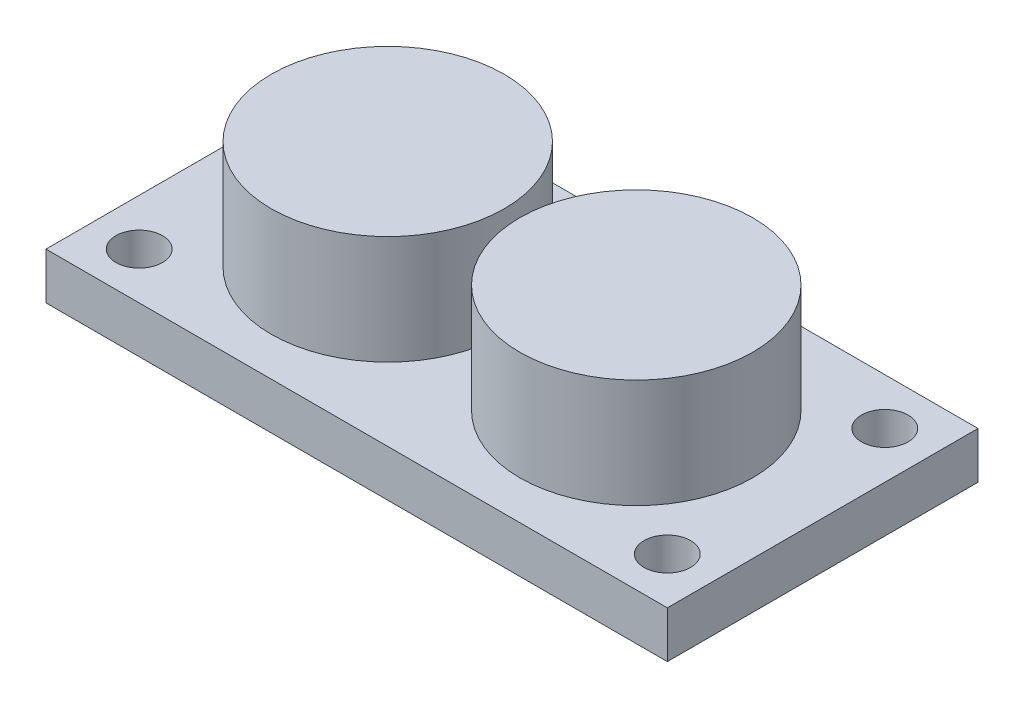
ISO-10303-21;
HEADER;
FILE_DESCRIPTION(('STEP AP214'),'2;1');
FILE_NAME('part.step','',(''),(''),'','','');
FILE_SCHEMA(('AUTOMOTIVE_DESIGN { 1 0 10303 214 1 1 1 1 }'));
ENDSEC;
DATA;
#1=APPLICATION_CONTEXT('core data for automotive mechanical design processes');
#2=APPLICATION_PROTOCOL_DEFINITION('international standard','automotive_design',2000,#1);
#3=PRODUCT_CONTEXT('',#1,'mechanical');
#4=PRODUCT('Part','Part','',(#3));
#5=PRODUCT_RELATED_PRODUCT_CATEGORY('part','',(#4));
#6=PRODUCT_DEFINITION_FORMATION('','',#4);
#7=PRODUCT_DEFINITION_CONTEXT('part definition',#1,'design');
#8=PRODUCT_DEFINITION('design','',#6,#7);
#9=PRODUCT_DEFINITION_SHAPE('','',#8);
#10=(LENGTH_UNIT() NAMED_UNIT(*) SI_UNIT(.MILLI.,.METRE.));
#11=(NAMED_UNIT(*) PLANE_ANGLE_UNIT() SI_UNIT($,.RADIAN.));
#12=(NAMED_UNIT(*) SI_UNIT($,.STERADIAN.) SOLID_ANGLE_UNIT());
#13=UNCERTAINTY_MEASURE_WITH_UNIT(LENGTH_MEASURE(1.E-05),#10,'distance_accuracy_value','');
#14=(GEOMETRIC_REPRESENTATION_CONTEXT(3) GLOBAL_UNCERTAINTY_ASSIGNED_CONTEXT((#13)) GLOBAL_UNIT_ASSIGNED_CONTEXT((#10,
#11,#12)) REPRESENTATION_CONTEXT('',''));
#15=CARTESIAN_POINT('',(0.,0.,0.));
#16=DIRECTION('',(0.,0.,1.));
#17=DIRECTION('',(1.,0.,0.));
#18=AXIS2_PLACEMENT_3D('',#15,#16,#17);
#19=CARTESIAN_POINT('',(0.,3.,0.));
#20=DIRECTION('',(0.,1.,0.));
#21=DIRECTION('',(0.,0.,1.));
#22=AXIS2_PLACEMENT_3D('',#19,#20,#21);
#23=PLANE('',#22);
#24=CARTESIAN_POINT('',(16.548532731377,3.,-5.84875846501129));
#25=DIRECTION('',(0.,1.,0.));
#26=DIRECTION('',(0.,0.,-1.));
#27=AXIS2_PLACEMENT_3D('',#24,#25,#26);
#28=CIRCLE('',#27,1.5);
#29=CARTESIAN_POINT('',(16.548532731377,3.,-7.34875846501129));
#30=VERTEX_POINT('',#29);
#31=EDGE_CURVE('E154',#30,#30,#28,.T.);
#32=ORIENTED_EDGE('',*,*,#31,.F.);
#33=EDGE_LOOP('',(#32));
#34=FACE_BOUND('',#33,.T.);
#35=CARTESIAN_POINT('',(-8.451467268623,3.,1.15124153498871));
#36=DIRECTION('',(0.,1.,0.));
#37=DIRECTION('',(0.,0.,1.));
#38=AXIS2_PLACEMENT_3D('',#35,#36,#37);
#39=CIRCLE('',#38,7.5);
#40=CARTESIAN_POINT('',(-8.451467268623,3.,8.65124153498871));
#41=VERTEX_POINT('',#40);
#42=EDGE_CURVE('E142',#41,#41,#39,.T.);
#43=ORIENTED_EDGE('',*,*,#42,.F.);
#44=EDGE_LOOP('',(#43));
#45=FACE_BOUND('',#44,.T.);
#46=CARTESIAN_POINT('',(-17.451467268623,3.,-5.84875846501129));
#47=DIRECTION('',(0.,1.,0.));
#48=DIRECTION('',(0.,0.,1.));
#49=AXIS2_PLACEMENT_3D('',#46,#47,#48);
#50=CIRCLE('',#49,1.5);
#51=CARTESIAN_POINT('',(-17.451467268623,3.,-4.34875846501129));
#52=VERTEX_POINT('',#51);
#53=EDGE_CURVE('E112',#52,#52,#50,.T.);
#54=ORIENTED_EDGE('',*,*,#53,.F.);
#55=EDGE_LOOP('',(#54));
#56=FACE_BOUND('',#55,.T.);
#57=DIRECTION('',(0.,0.,1.));
#58=VECTOR('',#57,1.);
#59=CARTESIAN_POINT('',(-20.451467268623,3.,-8.84875846501129));
#60=LINE('',#59,#58);
#61=CARTESIAN_POINT('',(-20.451467268623,3.,-8.84875846501129));
#62=VERTEX_POINT('',#61);
#63=CARTESIAN_POINT('',(-20.451467268623,3.,11.1512415349887));
#64=VERTEX_POINT('',#63);
#65=EDGE_CURVE('E92',#62,#64,#60,.T.);
#66=ORIENTED_EDGE('',*,*,#65,.T.);
#67=DIRECTION('',(1.,0.,0.));
#68=VECTOR('',#67,1.);
#69=CARTESIAN_POINT('',(-20.451467268623,3.,11.1512415349887));
#70=LINE('',#69,#68);
#71=CARTESIAN_POINT('',(19.548532731377,3.,11.1512415349887));
#72=VERTEX_POINT('',#71);
#73=EDGE_CURVE('E87',#64,#72,#70,.T.);
#74=ORIENTED_EDGE('',*,*,#73,.T.);
#75=DIRECTION('',(0.,0.,-1.));
#76=VECTOR('',#75,1.);
#77=CARTESIAN_POINT('',(19.548532731377,3.,-8.84875846501129));
#78=LINE('',#77,#76);
#79=CARTESIAN_POINT('',(19.548532731377,3.,-8.84875846501129));
#80=VERTEX_POINT('',#79);
#81=EDGE_CURVE('E90',#72,#80,#78,.T.);
#82=ORIENTED_EDGE('',*,*,#81,.T.);
#83=DIRECTION('',(-1.,0.,0.));
#84=VECTOR('',#83,1.);
#85=CARTESIAN_POINT('',(-20.451467268623,3.,-8.84875846501129));
#86=LINE('',#85,#84);
#87=EDGE_CURVE('E57',#80,#62,#86,.T.);
#88=ORIENTED_EDGE('',*,*,#87,.T.);
#89=EDGE_LOOP('',(#66,#74,#82,#88));
#90=FACE_BOUND('',#89,.T.);
#91=CARTESIAN_POINT('',(-17.451467268623,3.,8.15124153498871));
#92=DIRECTION('',(0.,1.,0.));
#93=DIRECTION('',(0.,0.,1.));
#94=AXIS2_PLACEMENT_3D('',#91,#92,#93);
#95=CIRCLE('',#94,1.5);
#96=CARTESIAN_POINT('',(-17.451467268623,3.,9.65124153498872));
#97=VERTEX_POINT('',#96);
#98=EDGE_CURVE('E134',#97,#97,#95,.T.);
#99=ORIENTED_EDGE('',*,*,#98,.F.);
#100=EDGE_LOOP('',(#99));
#101=FACE_BOUND('',#100,.T.);
#102=CARTESIAN_POINT('',(16.548532731377,3.,8.15124153498871));
#103=DIRECTION('',(0.,1.,0.));
#104=DIRECTION('',(0.,0.,-1.));
#105=AXIS2_PLACEMENT_3D('',#102,#103,#104);
#106=CIRCLE('',#105,1.5);
#107=CARTESIAN_POINT('',(16.548532731377,3.,6.65124153498871));
#108=VERTEX_POINT('',#107);
#109=EDGE_CURVE('E149',#108,#108,#106,.T.);
#110=ORIENTED_EDGE('',*,*,#109,.F.);
#111=EDGE_LOOP('',(#110));
#112=FACE_BOUND('',#111,.T.);
#113=CARTESIAN_POINT('',(7.54853273137699,3.,1.15124153498871));
#114=DIRECTION('',(0.,1.,0.));
#115=DIRECTION('',(0.,0.,-1.));
#116=AXIS2_PLACEMENT_3D('',#113,#114,#115);
#117=CIRCLE('',#116,7.5);
#118=CARTESIAN_POINT('',(7.54853273137699,3.,-6.34875846501129));
#119=VERTEX_POINT('',#118);
#120=EDGE_CURVE('E162',#119,#119,#117,.T.);
#121=ORIENTED_EDGE('',*,*,#120,.F.);
#122=EDGE_LOOP('',(#121));
#123=FACE_BOUND('',#122,.T.);
#124=ADVANCED_FACE('F39',(#34,#45,#56,#90,#101,#112,#123),#23,.T.);
#125=CARTESIAN_POINT('',(0.,0.,0.));
#126=DIRECTION('',(0.,1.,0.));
#127=DIRECTION('',(0.,0.,1.));
#128=AXIS2_PLACEMENT_3D('',#125,#126,#127);
#129=PLANE('',#128);
#130=DIRECTION('',(0.,0.,1.));
#131=VECTOR('',#130,1.);
#132=CARTESIAN_POINT('',(-20.451467268623,0.,-8.84875846501129));
#133=LINE('',#132,#131);
#134=CARTESIAN_POINT('',(-20.451467268623,0.,-8.84875846501129));
#135=VERTEX_POINT('',#134);
#136=CARTESIAN_POINT('',(-20.451467268623,0.,11.1512415349887));
#137=VERTEX_POINT('',#136);
#138=EDGE_CURVE('E108',#135,#137,#133,.T.);
#139=ORIENTED_EDGE('',*,*,#138,.F.);
#140=DIRECTION('',(-1.,0.,0.));
#141=VECTOR('',#140,1.);
#142=CARTESIAN_POINT('',(-20.451467268623,0.,-8.84875846501129));
#143=LINE('',#142,#141);
#144=CARTESIAN_POINT('',(19.548532731377,0.,-8.84875846501129));
#145=VERTEX_POINT('',#144);
#146=EDGE_CURVE('E80',#145,#135,#143,.T.);
#147=ORIENTED_EDGE('',*,*,#146,.F.);
#148=DIRECTION('',(0.,0.,-1.));
#149=VECTOR('',#148,1.);
#150=CARTESIAN_POINT('',(19.548532731377,0.,-8.84875846501129));
#151=LINE('',#150,#149);
#152=CARTESIAN_POINT('',(19.548532731377,0.,11.1512415349887));
#153=VERTEX_POINT('',#152);
#154=EDGE_CURVE('E74',#153,#145,#151,.T.);
#155=ORIENTED_EDGE('',*,*,#154,.F.);
#156=DIRECTION('',(1.,0.,0.));
#157=VECTOR('',#156,1.);
#158=CARTESIAN_POINT('',(-20.451467268623,0.,11.1512415349887));
#159=LINE('',#158,#157);
#160=EDGE_CURVE('E97',#137,#153,#159,.T.);
#161=ORIENTED_EDGE('',*,*,#160,.F.);
#162=EDGE_LOOP('',(#139,#147,#155,#161));
#163=FACE_BOUND('',#162,.T.);
#164=CARTESIAN_POINT('',(-17.451467268623,0.,-5.84875846501129));
#165=DIRECTION('',(0.,1.,0.));
#166=DIRECTION('',(0.,0.,1.));
#167=AXIS2_PLACEMENT_3D('',#164,#165,#166);
#168=CIRCLE('',#167,1.5);
#169=CARTESIAN_POINT('',(-17.451467268623,0.,-4.34875846501129));
#170=VERTEX_POINT('',#169);
#171=EDGE_CURVE('E130',#170,#170,#168,.T.);
#172=ORIENTED_EDGE('',*,*,#171,.T.);
#173=EDGE_LOOP('',(#172));
#174=FACE_BOUND('',#173,.T.);
#175=CARTESIAN_POINT('',(-17.451467268623,0.,8.15124153498871));
#176=DIRECTION('',(0.,1.,0.));
#177=DIRECTION('',(0.,0.,1.));
#178=AXIS2_PLACEMENT_3D('',#175,#176,#177);
#179=CIRCLE('',#178,1.5);
#180=CARTESIAN_POINT('',(-17.451467268623,0.,9.65124153498872));
#181=VERTEX_POINT('',#180);
#182=EDGE_CURVE('E138',#181,#181,#179,.T.);
#183=ORIENTED_EDGE('',*,*,#182,.T.);
#184=EDGE_LOOP('',(#183));
#185=FACE_BOUND('',#184,.T.);
#186=CARTESIAN_POINT('',(16.548532731377,0.,8.15124153498871));
#187=DIRECTION('',(0.,1.,0.));
#188=DIRECTION('',(0.,0.,-1.));
#189=AXIS2_PLACEMENT_3D('',#186,#187,#188);
#190=CIRCLE('',#189,1.5);
#191=CARTESIAN_POINT('',(16.548532731377,0.,6.65124153498871));
#192=VERTEX_POINT('',#191);
#193=EDGE_CURVE('E150',#192,#192,#190,.T.);
#194=ORIENTED_EDGE('',*,*,#193,.T.);
#195=EDGE_LOOP('',(#194));
#196=FACE_BOUND('',#195,.T.);
#197=CARTESIAN_POINT('',(16.548532731377,0.,-5.84875846501129));
#198=DIRECTION('',(0.,1.,0.));
#199=DIRECTION('',(0.,0.,-1.));
#200=AXIS2_PLACEMENT_3D('',#197,#198,#199);
#201=CIRCLE('',#200,1.5);
#202=CARTESIAN_POINT('',(16.548532731377,0.,-7.34875846501129));
#203=VERTEX_POINT('',#202);
#204=EDGE_CURVE('E158',#203,#203,#201,.T.);
#205=ORIENTED_EDGE('',*,*,#204,.T.);
#206=EDGE_LOOP('',(#205));
#207=FACE_BOUND('',#206,.T.);
#208=ADVANCED_FACE('F125',(#163,#174,#185,#196,#207),#129,.F.);
#209=CARTESIAN_POINT('',(-20.451467268623,3.,-8.84875846501129));
#210=DIRECTION('',(1.,0.,0.));
#211=DIRECTION('',(0.,0.,-1.));
#212=AXIS2_PLACEMENT_3D('',#209,#210,#211);
#213=PLANE('',#212);
#214=ORIENTED_EDGE('',*,*,#138,.T.);
#215=DIRECTION('',(0.,-1.,0.));
#216=VECTOR('',#215,1.);
#217=CARTESIAN_POINT('',(-20.451467268623,3.,11.1512415349887));
#218=LINE('',#217,#216);
#219=EDGE_CURVE('E11',#64,#137,#218,.T.);
#220=ORIENTED_EDGE('',*,*,#219,.F.);
#221=ORIENTED_EDGE('',*,*,#65,.F.);
#222=DIRECTION('',(0.,-1.,0.));
#223=VECTOR('',#222,1.);
#224=CARTESIAN_POINT('',(-20.451467268623,3.,-8.84875846501129));
#225=LINE('',#224,#223);
#226=EDGE_CURVE('E104',#62,#135,#225,.T.);
#227=ORIENTED_EDGE('',*,*,#226,.T.);
#228=EDGE_LOOP('',(#214,#220,#221,#227));
#229=FACE_BOUND('',#228,.T.);
#230=ADVANCED_FACE('F41',(#229),#213,.F.);
#231=CARTESIAN_POINT('',(-20.451467268623,3.,11.1512415349887));
#232=DIRECTION('',(0.,0.,-1.));
#233=DIRECTION('',(-1.,0.,0.));
#234=AXIS2_PLACEMENT_3D('',#231,#232,#233);
#235=PLANE('',#234);
#236=ORIENTED_EDGE('',*,*,#160,.T.);
#237=DIRECTION('',(0.,-1.,0.));
#238=VECTOR('',#237,1.);
#239=CARTESIAN_POINT('',(19.548532731377,3.,11.1512415349887));
#240=LINE('',#239,#238);
#241=EDGE_CURVE('E49',#72,#153,#240,.T.);
#242=ORIENTED_EDGE('',*,*,#241,.F.);
#243=ORIENTED_EDGE('',*,*,#73,.F.);
#244=ORIENTED_EDGE('',*,*,#219,.T.);
#245=EDGE_LOOP('',(#236,#242,#243,#244));
#246=FACE_BOUND('',#245,.T.);
#247=ADVANCED_FACE('F96',(#246),#235,.F.);
#248=CARTESIAN_POINT('',(19.548532731377,3.,-8.84875846501129));
#249=DIRECTION('',(-1.,0.,0.));
#250=DIRECTION('',(0.,0.,1.));
#251=AXIS2_PLACEMENT_3D('',#248,#249,#250);
#252=PLANE('',#251);
#253=ORIENTED_EDGE('',*,*,#154,.T.);
#254=DIRECTION('',(0.,-1.,0.));
#255=VECTOR('',#254,1.);
#256=CARTESIAN_POINT('',(19.548532731377,3.,-8.84875846501129));
#257=LINE('',#256,#255);
#258=EDGE_CURVE('E99',#80,#145,#257,.T.);
#259=ORIENTED_EDGE('',*,*,#258,.F.);
#260=ORIENTED_EDGE('',*,*,#81,.F.);
#261=ORIENTED_EDGE('',*,*,#241,.T.);
#262=EDGE_LOOP('',(#253,#259,#260,#261));
#263=FACE_BOUND('',#262,.T.);
#264=ADVANCED_FACE('F100',(#263),#252,.F.);
#265=CARTESIAN_POINT('',(-20.451467268623,3.,-8.84875846501129));
#266=DIRECTION('',(0.,0.,1.));
#267=DIRECTION('',(1.,0.,0.));
#268=AXIS2_PLACEMENT_3D('',#265,#266,#267);
#269=PLANE('',#268);
#270=ORIENTED_EDGE('',*,*,#146,.T.);
#271=ORIENTED_EDGE('',*,*,#226,.F.);
#272=ORIENTED_EDGE('',*,*,#87,.F.);
#273=ORIENTED_EDGE('',*,*,#258,.T.);
#274=EDGE_LOOP('',(#270,#271,#272,#273));
#275=FACE_BOUND('',#274,.T.);
#276=ADVANCED_FACE('F122',(#275),#269,.F.);
#277=CARTESIAN_POINT('',(-17.451467268623,3.,-5.84875846501129));
#278=DIRECTION('',(0.,-1.,0.));
#279=DIRECTION('',(0.,0.,-1.));
#280=AXIS2_PLACEMENT_3D('',#277,#278,#279);
#281=CYLINDRICAL_SURFACE('',#280,1.5);
#282=ORIENTED_EDGE('',*,*,#53,.T.);
#283=EDGE_LOOP('',(#282));
#284=FACE_BOUND('',#283,.T.);
#285=ORIENTED_EDGE('',*,*,#171,.F.);
#286=EDGE_LOOP('',(#285));
#287=FACE_BOUND('',#286,.T.);
#288=ADVANCED_FACE('F199',(#284,#287),#281,.F.);
#289=CARTESIAN_POINT('',(-17.451467268623,3.,8.15124153498871));
#290=DIRECTION('',(0.,-1.,0.));
#291=DIRECTION('',(0.,0.,-1.));
#292=AXIS2_PLACEMENT_3D('',#289,#290,#291);
#293=CYLINDRICAL_SURFACE('',#292,1.5);
#294=ORIENTED_EDGE('',*,*,#98,.T.);
#295=EDGE_LOOP('',(#294));
#296=FACE_BOUND('',#295,.T.);
#297=ORIENTED_EDGE('',*,*,#182,.F.);
#298=EDGE_LOOP('',(#297));
#299=FACE_BOUND('',#298,.T.);
#300=ADVANCED_FACE('F260',(#296,#299),#293,.F.);
#301=CARTESIAN_POINT('',(16.548532731377,3.,8.15124153498871));
#302=DIRECTION('',(0.,-1.,0.));
#303=DIRECTION('',(0.,0.,-1.));
#304=AXIS2_PLACEMENT_3D('',#301,#302,#303);
#305=CYLINDRICAL_SURFACE('',#304,1.5);
#306=ORIENTED_EDGE('',*,*,#109,.T.);
#307=EDGE_LOOP('',(#306));
#308=FACE_BOUND('',#307,.T.);
#309=ORIENTED_EDGE('',*,*,#193,.F.);
#310=EDGE_LOOP('',(#309));
#311=FACE_BOUND('',#310,.T.);
#312=ADVANCED_FACE('F257',(#308,#311),#305,.F.);
#313=CARTESIAN_POINT('',(16.548532731377,3.,-5.84875846501129));
#314=DIRECTION('',(0.,-1.,0.));
#315=DIRECTION('',(0.,0.,-1.));
#316=AXIS2_PLACEMENT_3D('',#313,#314,#315);
#317=CYLINDRICAL_SURFACE('',#316,1.5);
#318=ORIENTED_EDGE('',*,*,#31,.T.);
#319=EDGE_LOOP('',(#318));
#320=FACE_BOUND('',#319,.T.);
#321=ORIENTED_EDGE('',*,*,#204,.F.);
#322=EDGE_LOOP('',(#321));
#323=FACE_BOUND('',#322,.T.);
#324=ADVANCED_FACE('F223',(#320,#323),#317,.F.);
#325=CARTESIAN_POINT('',(-8.451467268623,10.,1.15124153498871));
#326=DIRECTION('',(0.,-1.,0.));
#327=DIRECTION('',(0.,0.,-1.));
#328=AXIS2_PLACEMENT_3D('',#325,#326,#327);
#329=CYLINDRICAL_SURFACE('',#328,7.5);
#330=ORIENTED_EDGE('',*,*,#42,.T.);
#331=EDGE_LOOP('',(#330));
#332=FACE_BOUND('',#331,.T.);
#333=CARTESIAN_POINT('',(-8.451467268623,10.,1.15124153498871));
#334=DIRECTION('',(0.,1.,0.));
#335=DIRECTION('',(0.,0.,1.));
#336=AXIS2_PLACEMENT_3D('',#333,#334,#335);
#337=CIRCLE('',#336,7.5);
#338=CARTESIAN_POINT('',(-8.451467268623,10.,8.65124153498871));
#339=VERTEX_POINT('',#338);
#340=EDGE_CURVE('E169',#339,#339,#337,.T.);
#341=ORIENTED_EDGE('',*,*,#340,.F.);
#342=EDGE_LOOP('',(#341));
#343=FACE_BOUND('',#342,.T.);
#344=ADVANCED_FACE('F228',(#332,#343),#329,.T.);
#345=CARTESIAN_POINT('',(0.,10.,0.));
#346=DIRECTION('',(0.,1.,0.));
#347=DIRECTION('',(0.,0.,1.));
#348=AXIS2_PLACEMENT_3D('',#345,#346,#347);
#349=PLANE('',#348);
#350=ORIENTED_EDGE('',*,*,#340,.T.);
#351=EDGE_LOOP('',(#350));
#352=FACE_BOUND('',#351,.T.);
#353=ADVANCED_FACE('F186',(#352),#349,.T.);
#354=CARTESIAN_POINT('',(7.54853273137699,10.,1.15124153498871));
#355=DIRECTION('',(0.,-1.,0.));
#356=DIRECTION('',(0.,0.,-1.));
#357=AXIS2_PLACEMENT_3D('',#354,#355,#356);
#358=CYLINDRICAL_SURFACE('',#357,7.5);
#359=ORIENTED_EDGE('',*,*,#120,.T.);
#360=EDGE_LOOP('',(#359));
#361=FACE_BOUND('',#360,.T.);
#362=CARTESIAN_POINT('',(7.54853273137699,10.,1.15124153498871));
#363=DIRECTION('',(0.,1.,0.));
#364=DIRECTION('',(0.,0.,1.));
#365=AXIS2_PLACEMENT_3D('',#362,#363,#364);
#366=CIRCLE('',#365,7.5);
#367=CARTESIAN_POINT('',(7.54853273137699,10.,8.65124153498871));
#368=VERTEX_POINT('',#367);
#369=EDGE_CURVE('E173',#368,#368,#366,.F.);
#370=ORIENTED_EDGE('',*,*,#369,.T.);
#371=EDGE_LOOP('',(#370));
#372=FACE_BOUND('',#371,.T.);
#373=ADVANCED_FACE('F178',(#361,#372),#358,.T.);
#374=CARTESIAN_POINT('',(0.,10.,0.));
#375=DIRECTION('',(0.,1.,0.));
#376=DIRECTION('',(0.,0.,1.));
#377=AXIS2_PLACEMENT_3D('',#374,#375,#376);
#378=PLANE('',#377);
#379=ORIENTED_EDGE('',*,*,#369,.F.);
#380=EDGE_LOOP('',(#379));
#381=FACE_BOUND('',#380,.T.);
#382=ADVANCED_FACE('F180',(#381),#378,.T.);
#383=CLOSED_SHELL('',(#124,#208,#230,#247,#264,#276,#288,#300,#312,#324,#344,#353,#373,#382));
#384=MANIFOLD_SOLID_BREP('B2',#383);
#385=ADVANCED_BREP_SHAPE_REPRESENTATION('',(#18,#384),#14);
#386=SHAPE_DEFINITION_REPRESENTATION(#9,#385);
ENDSEC;
END-ISO-10303-21;
